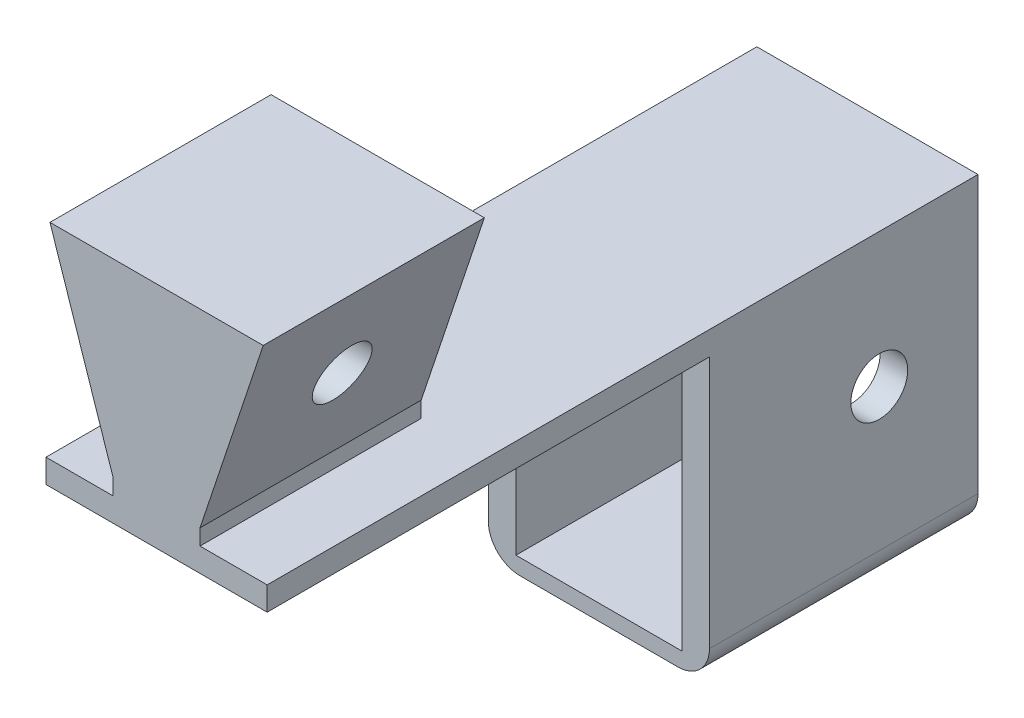
ISO-10303-21;
HEADER;
FILE_DESCRIPTION(('STEP AP214'),'2;1');
FILE_NAME('part.step','',(''),(''),'','','');
FILE_SCHEMA(('AUTOMOTIVE_DESIGN { 1 0 10303 214 1 1 1 1 }'));
ENDSEC;
DATA;
#1=APPLICATION_CONTEXT('core data for automotive mechanical design processes');
#2=APPLICATION_PROTOCOL_DEFINITION('international standard','automotive_design',2000,#1);
#3=PRODUCT_CONTEXT('',#1,'mechanical');
#4=PRODUCT('Part','Part','',(#3));
#5=PRODUCT_RELATED_PRODUCT_CATEGORY('part','',(#4));
#6=PRODUCT_DEFINITION_FORMATION('','',#4);
#7=PRODUCT_DEFINITION_CONTEXT('part definition',#1,'design');
#8=PRODUCT_DEFINITION('design','',#6,#7);
#9=PRODUCT_DEFINITION_SHAPE('','',#8);
#10=(LENGTH_UNIT() NAMED_UNIT(*) SI_UNIT(.MILLI.,.METRE.));
#11=(NAMED_UNIT(*) PLANE_ANGLE_UNIT() SI_UNIT($,.RADIAN.));
#12=(NAMED_UNIT(*) SI_UNIT($,.STERADIAN.) SOLID_ANGLE_UNIT());
#13=UNCERTAINTY_MEASURE_WITH_UNIT(LENGTH_MEASURE(1.E-05),#10,'distance_accuracy_value','');
#14=(GEOMETRIC_REPRESENTATION_CONTEXT(3) GLOBAL_UNCERTAINTY_ASSIGNED_CONTEXT((#13)) GLOBAL_UNIT_ASSIGNED_CONTEXT((#10,
#11,#12)) REPRESENTATION_CONTEXT('',''));
#15=CARTESIAN_POINT('',(0.,0.,0.));
#16=DIRECTION('',(0.,0.,1.));
#17=DIRECTION('',(1.,0.,0.));
#18=AXIS2_PLACEMENT_3D('',#15,#16,#17);
#19=CARTESIAN_POINT('',(0.,-1.5,0.));
#20=DIRECTION('',(0.,-1.,0.));
#21=DIRECTION('',(0.,0.,-1.));
#22=AXIS2_PLACEMENT_3D('',#19,#20,#21);
#23=PLANE('',#22);
#24=DIRECTION('',(-1.,0.,0.));
#25=VECTOR('',#24,1.);
#26=CARTESIAN_POINT('',(-4.25,-1.5,-14.));
#27=LINE('',#26,#25);
#28=CARTESIAN_POINT('',(-2.5,-1.5,-14.));
#29=VERTEX_POINT('',#28);
#30=CARTESIAN_POINT('',(-4.25,-1.5,-14.));
#31=VERTEX_POINT('',#30);
#32=EDGE_CURVE('E210',#29,#31,#27,.T.);
#33=ORIENTED_EDGE('',*,*,#32,.F.);
#34=DIRECTION('',(0.,0.,1.));
#35=VECTOR('',#34,1.);
#36=CARTESIAN_POINT('',(-2.5,-1.5,-14.));
#37=LINE('',#36,#35);
#38=CARTESIAN_POINT('',(-2.5,-1.5,-31.));
#39=VERTEX_POINT('',#38);
#40=EDGE_CURVE('E211',#39,#29,#37,.T.);
#41=ORIENTED_EDGE('',*,*,#40,.F.);
#42=DIRECTION('',(1.,0.,0.));
#43=VECTOR('',#42,1.);
#44=CARTESIAN_POINT('',(-4.24999999999999,-1.5,-31.));
#45=LINE('',#44,#43);
#46=CARTESIAN_POINT('',(8.,-1.5,-31.));
#47=VERTEX_POINT('',#46);
#48=EDGE_CURVE('E239',#39,#47,#45,.T.);
#49=ORIENTED_EDGE('',*,*,#48,.T.);
#50=DIRECTION('',(0.,0.,-1.));
#51=VECTOR('',#50,1.);
#52=CARTESIAN_POINT('',(8.,-1.5,-14.));
#53=LINE('',#52,#51);
#54=CARTESIAN_POINT('',(8.,-1.5,-14.));
#55=VERTEX_POINT('',#54);
#56=EDGE_CURVE('E177',#55,#47,#53,.T.);
#57=ORIENTED_EDGE('',*,*,#56,.F.);
#58=DIRECTION('',(-1.,0.,0.));
#59=VECTOR('',#58,1.);
#60=CARTESIAN_POINT('',(9.75,-1.5,-14.));
#61=LINE('',#60,#59);
#62=CARTESIAN_POINT('',(9.75,-1.5,-14.));
#63=VERTEX_POINT('',#62);
#64=EDGE_CURVE('E186',#63,#55,#61,.T.);
#65=ORIENTED_EDGE('',*,*,#64,.F.);
#66=DIRECTION('',(0.,0.,1.));
#67=VECTOR('',#66,1.);
#68=CARTESIAN_POINT('',(9.75,-1.5,14.));
#69=LINE('',#68,#67);
#70=CARTESIAN_POINT('',(9.75,-1.5,14.));
#71=VERTEX_POINT('',#70);
#72=EDGE_CURVE('E243',#63,#71,#69,.T.);
#73=ORIENTED_EDGE('',*,*,#72,.T.);
#74=DIRECTION('',(-1.,0.,0.));
#75=VECTOR('',#74,1.);
#76=CARTESIAN_POINT('',(-4.25,-1.5,14.));
#77=LINE('',#76,#75);
#78=CARTESIAN_POINT('',(-4.25,-1.5,14.));
#79=VERTEX_POINT('',#78);
#80=EDGE_CURVE('E246',#71,#79,#77,.T.);
#81=ORIENTED_EDGE('',*,*,#80,.T.);
#82=DIRECTION('',(0.,0.,-1.));
#83=VECTOR('',#82,1.);
#84=CARTESIAN_POINT('',(-4.25,-1.5,14.));
#85=LINE('',#84,#83);
#86=EDGE_CURVE('E235',#79,#31,#85,.T.);
#87=ORIENTED_EDGE('',*,*,#86,.T.);
#88=EDGE_LOOP('',(#33,#41,#49,#57,#65,#73,#81,#87));
#89=FACE_BOUND('',#88,.T.);
#90=ADVANCED_FACE('F39',(#89),#23,.T.);
#91=CARTESIAN_POINT('',(0.,0.999999999999998,14.));
#92=DIRECTION('',(1.,0.,0.));
#93=DIRECTION('',(0.,0.,-1.));
#94=AXIS2_PLACEMENT_3D('',#91,#92,#93);
#95=PLANE('',#94);
#96=DIRECTION('',(0.,-1.,0.));
#97=VECTOR('',#96,1.);
#98=CARTESIAN_POINT('',(0.,0.999999999999998,0.));
#99=LINE('',#98,#97);
#100=CARTESIAN_POINT('',(0.,0.999999999999998,0.));
#101=VERTEX_POINT('',#100);
#102=CARTESIAN_POINT('',(0.,0.,0.));
#103=VERTEX_POINT('',#102);
#104=EDGE_CURVE('E295',#101,#103,#99,.T.);
#105=ORIENTED_EDGE('',*,*,#104,.T.);
#106=DIRECTION('',(0.,0.,-1.));
#107=VECTOR('',#106,1.);
#108=CARTESIAN_POINT('',(0.,0.,14.));
#109=LINE('',#108,#107);
#110=CARTESIAN_POINT('',(0.,0.,14.));
#111=VERTEX_POINT('',#110);
#112=EDGE_CURVE('E331',#111,#103,#109,.T.);
#113=ORIENTED_EDGE('',*,*,#112,.F.);
#114=DIRECTION('',(0.,-1.,0.));
#115=VECTOR('',#114,1.);
#116=CARTESIAN_POINT('',(0.,0.999999999999998,14.));
#117=LINE('',#116,#115);
#118=CARTESIAN_POINT('',(0.,0.999999999999998,14.));
#119=VERTEX_POINT('',#118);
#120=EDGE_CURVE('E278',#119,#111,#117,.T.);
#121=ORIENTED_EDGE('',*,*,#120,.F.);
#122=DIRECTION('',(0.,0.,-1.));
#123=VECTOR('',#122,1.);
#124=CARTESIAN_POINT('',(0.,0.999999999999998,14.));
#125=LINE('',#124,#123);
#126=EDGE_CURVE('E294',#119,#101,#125,.T.);
#127=ORIENTED_EDGE('',*,*,#126,.T.);
#128=EDGE_LOOP('',(#105,#113,#121,#127));
#129=FACE_BOUND('',#128,.T.);
#130=ADVANCED_FACE('F427',(#129),#95,.F.);
#131=CARTESIAN_POINT('',(5.5,0.,14.));
#132=DIRECTION('',(-1.,0.,0.));
#133=DIRECTION('',(0.,0.,1.));
#134=AXIS2_PLACEMENT_3D('',#131,#132,#133);
#135=PLANE('',#134);
#136=DIRECTION('',(0.,1.,0.));
#137=VECTOR('',#136,1.);
#138=CARTESIAN_POINT('',(5.5,0.,0.));
#139=LINE('',#138,#137);
#140=CARTESIAN_POINT('',(5.5,0.,0.));
#141=VERTEX_POINT('',#140);
#142=CARTESIAN_POINT('',(5.5,0.999999999999999,0.));
#143=VERTEX_POINT('',#142);
#144=EDGE_CURVE('E302',#141,#143,#139,.T.);
#145=ORIENTED_EDGE('',*,*,#144,.T.);
#146=DIRECTION('',(0.,0.,-1.));
#147=VECTOR('',#146,1.);
#148=CARTESIAN_POINT('',(5.5,0.999999999999999,14.));
#149=LINE('',#148,#147);
#150=CARTESIAN_POINT('',(5.5,0.999999999999999,14.));
#151=VERTEX_POINT('',#150);
#152=EDGE_CURVE('E324',#151,#143,#149,.T.);
#153=ORIENTED_EDGE('',*,*,#152,.F.);
#154=DIRECTION('',(0.,1.,0.));
#155=VECTOR('',#154,1.);
#156=CARTESIAN_POINT('',(5.5,0.,14.));
#157=LINE('',#156,#155);
#158=CARTESIAN_POINT('',(5.5,0.,14.));
#159=VERTEX_POINT('',#158);
#160=EDGE_CURVE('E281',#159,#151,#157,.T.);
#161=ORIENTED_EDGE('',*,*,#160,.F.);
#162=DIRECTION('',(0.,0.,-1.));
#163=VECTOR('',#162,1.);
#164=CARTESIAN_POINT('',(5.5,0.,14.));
#165=LINE('',#164,#163);
#166=EDGE_CURVE('E328',#159,#141,#165,.T.);
#167=ORIENTED_EDGE('',*,*,#166,.T.);
#168=EDGE_LOOP('',(#145,#153,#161,#167));
#169=FACE_BOUND('',#168,.T.);
#170=ADVANCED_FACE('F432',(#169),#135,.F.);
#171=CARTESIAN_POINT('',(5.5,0.999999999999999,14.));
#172=DIRECTION('',(-0.948683298050514,0.316227766016838,0.));
#173=DIRECTION('',(-0.316227766016838,-0.948683298050514,0.));
#174=AXIS2_PLACEMENT_3D('',#171,#172,#173);
#175=PLANE('',#174);
#176=CARTESIAN_POINT('',(7.5,7.,7.));
#177=DIRECTION('',(-0.948683298050514,0.316227766016838,0.));
#178=DIRECTION('',(-0.316227766016838,-0.948683298050514,0.));
#179=AXIS2_PLACEMENT_3D('',#176,#177,#178);
#180=ELLIPSE('',#179,1.89736659610102,1.79999999999999);
#181=CARTESIAN_POINT('',(6.9,5.20000000000001,7.));
#182=VERTEX_POINT('',#181);
#183=EDGE_CURVE('E277',#182,#182,#180,.T.);
#184=ORIENTED_EDGE('',*,*,#183,.T.);
#185=EDGE_LOOP('',(#184));
#186=FACE_BOUND('',#185,.T.);
#187=DIRECTION('',(0.316227766016838,0.948683298050514,0.));
#188=VECTOR('',#187,1.);
#189=CARTESIAN_POINT('',(5.5,0.999999999999999,0.));
#190=LINE('',#189,#188);
#191=CARTESIAN_POINT('',(9.5,13.,0.));
#192=VERTEX_POINT('',#191);
#193=EDGE_CURVE('E305',#143,#192,#190,.T.);
#194=ORIENTED_EDGE('',*,*,#193,.T.);
#195=DIRECTION('',(0.,0.,-1.));
#196=VECTOR('',#195,1.);
#197=CARTESIAN_POINT('',(9.5,13.,14.));
#198=LINE('',#197,#196);
#199=CARTESIAN_POINT('',(9.5,13.,14.));
#200=VERTEX_POINT('',#199);
#201=EDGE_CURVE('E320',#200,#192,#198,.T.);
#202=ORIENTED_EDGE('',*,*,#201,.F.);
#203=DIRECTION('',(0.316227766016838,0.948683298050514,0.));
#204=VECTOR('',#203,1.);
#205=CARTESIAN_POINT('',(5.5,0.999999999999999,14.));
#206=LINE('',#205,#204);
#207=EDGE_CURVE('E285',#151,#200,#206,.T.);
#208=ORIENTED_EDGE('',*,*,#207,.F.);
#209=ORIENTED_EDGE('',*,*,#152,.T.);
#210=EDGE_LOOP('',(#194,#202,#208,#209));
#211=FACE_BOUND('',#210,.T.);
#212=ADVANCED_FACE('F614',(#186,#211),#175,.F.);
#213=CARTESIAN_POINT('',(9.5,13.,14.));
#214=DIRECTION('',(0.,-1.,0.));
#215=DIRECTION('',(1.,0.,0.));
#216=AXIS2_PLACEMENT_3D('',#213,#214,#215);
#217=PLANE('',#216);
#218=DIRECTION('',(-1.,0.,0.));
#219=VECTOR('',#218,1.);
#220=CARTESIAN_POINT('',(9.5,13.,0.));
#221=LINE('',#220,#219);
#222=CARTESIAN_POINT('',(-4.,13.,0.));
#223=VERTEX_POINT('',#222);
#224=EDGE_CURVE('E308',#192,#223,#221,.T.);
#225=ORIENTED_EDGE('',*,*,#224,.T.);
#226=DIRECTION('',(0.,0.,-1.));
#227=VECTOR('',#226,1.);
#228=CARTESIAN_POINT('',(-4.,13.,14.));
#229=LINE('',#228,#227);
#230=CARTESIAN_POINT('',(-4.,13.,14.));
#231=VERTEX_POINT('',#230);
#232=EDGE_CURVE('E316',#231,#223,#229,.T.);
#233=ORIENTED_EDGE('',*,*,#232,.F.);
#234=DIRECTION('',(-1.,0.,0.));
#235=VECTOR('',#234,1.);
#236=CARTESIAN_POINT('',(9.5,13.,14.));
#237=LINE('',#236,#235);
#238=EDGE_CURVE('E288',#200,#231,#237,.T.);
#239=ORIENTED_EDGE('',*,*,#238,.F.);
#240=ORIENTED_EDGE('',*,*,#201,.T.);
#241=EDGE_LOOP('',(#225,#233,#239,#240));
#242=FACE_BOUND('',#241,.T.);
#243=ADVANCED_FACE('F523',(#242),#217,.F.);
#244=CARTESIAN_POINT('',(-4.,13.,14.));
#245=DIRECTION('',(0.948683298050514,0.316227766016838,0.));
#246=DIRECTION('',(-0.316227766016838,0.948683298050514,0.));
#247=AXIS2_PLACEMENT_3D('',#244,#245,#246);
#248=PLANE('',#247);
#249=CARTESIAN_POINT('',(-2.,7.,7.));
#250=DIRECTION('',(0.948683298050514,0.316227766016838,0.));
#251=DIRECTION('',(0.316227766016838,-0.948683298050514,0.));
#252=AXIS2_PLACEMENT_3D('',#249,#250,#251);
#253=ELLIPSE('',#252,1.89736659610102,1.79999999999999);
#254=CARTESIAN_POINT('',(-1.4,5.20000000000001,7.));
#255=VERTEX_POINT('',#254);
#256=EDGE_CURVE('E402',#255,#255,#253,.T.);
#257=ORIENTED_EDGE('',*,*,#256,.T.);
#258=EDGE_LOOP('',(#257));
#259=FACE_BOUND('',#258,.T.);
#260=DIRECTION('',(0.316227766016838,-0.948683298050514,0.));
#261=VECTOR('',#260,1.);
#262=CARTESIAN_POINT('',(-4.,13.,0.));
#263=LINE('',#262,#261);
#264=EDGE_CURVE('E282',#223,#101,#263,.T.);
#265=ORIENTED_EDGE('',*,*,#264,.T.);
#266=ORIENTED_EDGE('',*,*,#126,.F.);
#267=DIRECTION('',(0.316227766016838,-0.948683298050514,0.));
#268=VECTOR('',#267,1.);
#269=CARTESIAN_POINT('',(-4.,13.,14.));
#270=LINE('',#269,#268);
#271=EDGE_CURVE('E291',#231,#119,#270,.T.);
#272=ORIENTED_EDGE('',*,*,#271,.F.);
#273=ORIENTED_EDGE('',*,*,#232,.T.);
#274=EDGE_LOOP('',(#265,#266,#272,#273));
#275=FACE_BOUND('',#274,.T.);
#276=ADVANCED_FACE('F407',(#259,#275),#248,.F.);
#277=CARTESIAN_POINT('',(0.,0.,14.));
#278=DIRECTION('',(0.,0.,1.));
#279=DIRECTION('',(1.,0.,0.));
#280=AXIS2_PLACEMENT_3D('',#277,#278,#279);
#281=PLANE('',#280);
#282=ORIENTED_EDGE('',*,*,#120,.T.);
#283=DIRECTION('',(-1.,0.,0.));
#284=VECTOR('',#283,1.);
#285=CARTESIAN_POINT('',(-4.25,0.,14.));
#286=LINE('',#285,#284);
#287=CARTESIAN_POINT('',(-4.25,0.,14.));
#288=VERTEX_POINT('',#287);
#289=EDGE_CURVE('E260',#111,#288,#286,.T.);
#290=ORIENTED_EDGE('',*,*,#289,.T.);
#291=DIRECTION('',(0.,1.,0.));
#292=VECTOR('',#291,1.);
#293=CARTESIAN_POINT('',(-4.25,-1.5,14.));
#294=LINE('',#293,#292);
#295=EDGE_CURVE('E249',#79,#288,#294,.T.);
#296=ORIENTED_EDGE('',*,*,#295,.F.);
#297=ORIENTED_EDGE('',*,*,#80,.F.);
#298=DIRECTION('',(0.,1.,0.));
#299=VECTOR('',#298,1.);
#300=CARTESIAN_POINT('',(9.75,-1.5,14.));
#301=LINE('',#300,#299);
#302=CARTESIAN_POINT('',(9.75,0.,14.));
#303=VERTEX_POINT('',#302);
#304=EDGE_CURVE('E267',#71,#303,#301,.T.);
#305=ORIENTED_EDGE('',*,*,#304,.T.);
#306=EDGE_CURVE('E240',#303,#159,#286,.T.);
#307=ORIENTED_EDGE('',*,*,#306,.T.);
#308=ORIENTED_EDGE('',*,*,#160,.T.);
#309=ORIENTED_EDGE('',*,*,#207,.T.);
#310=ORIENTED_EDGE('',*,*,#238,.T.);
#311=ORIENTED_EDGE('',*,*,#271,.T.);
#312=EDGE_LOOP('',(#282,#290,#296,#297,#305,#307,#308,#309,#310,#311));
#313=FACE_BOUND('',#312,.T.);
#314=ADVANCED_FACE('F421',(#313),#281,.T.);
#315=CARTESIAN_POINT('',(0.,0.,0.));
#316=DIRECTION('',(0.,0.,1.));
#317=DIRECTION('',(1.,0.,0.));
#318=AXIS2_PLACEMENT_3D('',#315,#316,#317);
#319=PLANE('',#318);
#320=ORIENTED_EDGE('',*,*,#104,.F.);
#321=ORIENTED_EDGE('',*,*,#264,.F.);
#322=ORIENTED_EDGE('',*,*,#224,.F.);
#323=ORIENTED_EDGE('',*,*,#193,.F.);
#324=ORIENTED_EDGE('',*,*,#144,.F.);
#325=DIRECTION('',(1.,0.,0.));
#326=VECTOR('',#325,1.);
#327=CARTESIAN_POINT('',(0.,0.,0.));
#328=LINE('',#327,#326);
#329=EDGE_CURVE('E298',#103,#141,#328,.T.);
#330=ORIENTED_EDGE('',*,*,#329,.F.);
#331=EDGE_LOOP('',(#320,#321,#322,#323,#324,#330));
#332=FACE_BOUND('',#331,.T.);
#333=ADVANCED_FACE('F412',(#332),#319,.F.);
#334=CARTESIAN_POINT('',(0.,7.,7.));
#335=DIRECTION('',(-1.,0.,0.));
#336=DIRECTION('',(0.,0.,1.));
#337=AXIS2_PLACEMENT_3D('',#334,#335,#336);
#338=CYLINDRICAL_SURFACE('',#337,1.79999999999999);
#339=ORIENTED_EDGE('',*,*,#183,.F.);
#340=EDGE_LOOP('',(#339));
#341=FACE_BOUND('',#340,.T.);
#342=ORIENTED_EDGE('',*,*,#256,.F.);
#343=EDGE_LOOP('',(#342));
#344=FACE_BOUND('',#343,.T.);
#345=ADVANCED_FACE('F410',(#341,#344),#338,.F.);
#346=CARTESIAN_POINT('',(-4.25,-1.5,14.));
#347=DIRECTION('',(1.,0.,0.));
#348=DIRECTION('',(0.,0.,-1.));
#349=AXIS2_PLACEMENT_3D('',#346,#347,#348);
#350=PLANE('',#349);
#351=CARTESIAN_POINT('',(-4.25,-8.5,-24.75));
#352=DIRECTION('',(-1.,0.,0.));
#353=DIRECTION('',(0.,0.,1.));
#354=AXIS2_PLACEMENT_3D('',#351,#352,#353);
#355=CIRCLE('',#354,1.79999999999999);
#356=CARTESIAN_POINT('',(-4.25,-8.5,-22.95));
#357=VERTEX_POINT('',#356);
#358=EDGE_CURVE('E398',#357,#357,#355,.T.);
#359=ORIENTED_EDGE('',*,*,#358,.F.);
#360=EDGE_LOOP('',(#359));
#361=FACE_BOUND('',#360,.T.);
#362=DIRECTION('',(0.,1.,0.));
#363=VECTOR('',#362,1.);
#364=CARTESIAN_POINT('',(-4.24999999999999,-1.5,-31.));
#365=LINE('',#364,#363);
#366=CARTESIAN_POINT('',(-4.24999999999999,-17.5,-31.));
#367=VERTEX_POINT('',#366);
#368=CARTESIAN_POINT('',(-4.24999999999999,0.,-31.));
#369=VERTEX_POINT('',#368);
#370=EDGE_CURVE('E274',#367,#369,#365,.T.);
#371=ORIENTED_EDGE('',*,*,#370,.F.);
#372=DIRECTION('',(0.,0.,-1.));
#373=VECTOR('',#372,1.);
#374=CARTESIAN_POINT('',(-4.25,-17.5,-14.));
#375=LINE('',#374,#373);
#376=CARTESIAN_POINT('',(-4.25,-17.5,-14.));
#377=VERTEX_POINT('',#376);
#378=EDGE_CURVE('E11',#367,#377,#375,.F.);
#379=ORIENTED_EDGE('',*,*,#378,.T.);
#380=DIRECTION('',(0.,1.,0.));
#381=VECTOR('',#380,1.);
#382=CARTESIAN_POINT('',(-4.25,-18.5,-14.));
#383=LINE('',#382,#381);
#384=EDGE_CURVE('E209',#377,#31,#383,.T.);
#385=ORIENTED_EDGE('',*,*,#384,.T.);
#386=ORIENTED_EDGE('',*,*,#86,.F.);
#387=ORIENTED_EDGE('',*,*,#295,.T.);
#388=DIRECTION('',(0.,0.,-1.));
#389=VECTOR('',#388,1.);
#390=CARTESIAN_POINT('',(-4.25,0.,14.));
#391=LINE('',#390,#389);
#392=EDGE_CURVE('E234',#288,#369,#391,.T.);
#393=ORIENTED_EDGE('',*,*,#392,.T.);
#394=EDGE_LOOP('',(#371,#379,#385,#386,#387,#393));
#395=FACE_BOUND('',#394,.T.);
#396=ADVANCED_FACE('F381',(#361,#395),#350,.F.);
#397=CARTESIAN_POINT('',(-4.24999999999999,-1.5,-31.));
#398=DIRECTION('',(0.,0.,1.));
#399=DIRECTION('',(1.,0.,0.));
#400=AXIS2_PLACEMENT_3D('',#397,#398,#399);
#401=PLANE('',#400);
#402=DIRECTION('',(0.,1.,0.));
#403=VECTOR('',#402,1.);
#404=CARTESIAN_POINT('',(9.75,-1.5,-31.));
#405=LINE('',#404,#403);
#406=CARTESIAN_POINT('',(9.75,-17.5,-31.));
#407=VERTEX_POINT('',#406);
#408=CARTESIAN_POINT('',(9.75,0.,-31.));
#409=VERTEX_POINT('',#408);
#410=EDGE_CURVE('E271',#407,#409,#405,.T.);
#411=ORIENTED_EDGE('',*,*,#410,.F.);
#412=CARTESIAN_POINT('',(7.75,-17.5,-31.));
#413=DIRECTION('',(0.,0.,1.));
#414=DIRECTION('',(1.,0.,0.));
#415=AXIS2_PLACEMENT_3D('',#412,#413,#414);
#416=CIRCLE('',#415,2.);
#417=CARTESIAN_POINT('',(7.75,-19.5,-31.));
#418=VERTEX_POINT('',#417);
#419=EDGE_CURVE('E48',#407,#418,#416,.F.);
#420=ORIENTED_EDGE('',*,*,#419,.T.);
#421=DIRECTION('',(1.,0.,0.));
#422=VECTOR('',#421,1.);
#423=CARTESIAN_POINT('',(-4.25,-19.5,-31.));
#424=LINE('',#423,#422);
#425=CARTESIAN_POINT('',(-2.25,-19.5,-31.));
#426=VERTEX_POINT('',#425);
#427=EDGE_CURVE('E195',#426,#418,#424,.T.);
#428=ORIENTED_EDGE('',*,*,#427,.F.);
#429=CARTESIAN_POINT('',(-2.25,-17.5,-31.));
#430=DIRECTION('',(0.,0.,1.));
#431=DIRECTION('',(1.,0.,0.));
#432=AXIS2_PLACEMENT_3D('',#429,#430,#431);
#433=CIRCLE('',#432,2.);
#434=EDGE_CURVE('E55',#426,#367,#433,.F.);
#435=ORIENTED_EDGE('',*,*,#434,.T.);
#436=ORIENTED_EDGE('',*,*,#370,.T.);
#437=DIRECTION('',(1.,0.,0.));
#438=VECTOR('',#437,1.);
#439=CARTESIAN_POINT('',(-4.24999999999999,0.,-31.));
#440=LINE('',#439,#438);
#441=EDGE_CURVE('E253',#369,#409,#440,.T.);
#442=ORIENTED_EDGE('',*,*,#441,.T.);
#443=EDGE_LOOP('',(#411,#420,#428,#435,#436,#442));
#444=FACE_BOUND('',#443,.T.);
#445=DIRECTION('',(1.,0.,0.));
#446=VECTOR('',#445,1.);
#447=CARTESIAN_POINT('',(-4.25,-18.5,-31.));
#448=LINE('',#447,#446);
#449=CARTESIAN_POINT('',(-2.5,-18.5,-31.));
#450=VERTEX_POINT('',#449);
#451=CARTESIAN_POINT('',(8.00000000000001,-18.5,-31.));
#452=VERTEX_POINT('',#451);
#453=EDGE_CURVE('E196',#450,#452,#448,.T.);
#454=ORIENTED_EDGE('',*,*,#453,.T.);
#455=DIRECTION('',(0.,1.,0.));
#456=VECTOR('',#455,1.);
#457=CARTESIAN_POINT('',(8.00000000000001,-18.5,-31.));
#458=LINE('',#457,#456);
#459=EDGE_CURVE('E171',#452,#47,#458,.T.);
#460=ORIENTED_EDGE('',*,*,#459,.T.);
#461=ORIENTED_EDGE('',*,*,#48,.F.);
#462=DIRECTION('',(0.,1.,0.));
#463=VECTOR('',#462,1.);
#464=CARTESIAN_POINT('',(-2.5,-18.5,-31.));
#465=LINE('',#464,#463);
#466=EDGE_CURVE('E223',#450,#39,#465,.T.);
#467=ORIENTED_EDGE('',*,*,#466,.F.);
#468=EDGE_LOOP('',(#454,#460,#461,#467));
#469=FACE_BOUND('',#468,.T.);
#470=ADVANCED_FACE('F357',(#444,#469),#401,.F.);
#471=CARTESIAN_POINT('',(9.75,-1.5,14.));
#472=DIRECTION('',(-1.,0.,0.));
#473=DIRECTION('',(0.,0.,1.));
#474=AXIS2_PLACEMENT_3D('',#471,#472,#473);
#475=PLANE('',#474);
#476=CARTESIAN_POINT('',(9.75000000000001,-8.5,-24.75));
#477=DIRECTION('',(-1.,0.,0.));
#478=DIRECTION('',(0.,0.,1.));
#479=AXIS2_PLACEMENT_3D('',#476,#477,#478);
#480=CIRCLE('',#479,1.8);
#481=CARTESIAN_POINT('',(9.75000000000001,-8.5,-22.95));
#482=VERTEX_POINT('',#481);
#483=EDGE_CURVE('E394',#482,#482,#480,.T.);
#484=ORIENTED_EDGE('',*,*,#483,.T.);
#485=EDGE_LOOP('',(#484));
#486=FACE_BOUND('',#485,.T.);
#487=DIRECTION('',(0.,1.,0.));
#488=VECTOR('',#487,1.);
#489=CARTESIAN_POINT('',(9.75,-18.5,-14.));
#490=LINE('',#489,#488);
#491=CARTESIAN_POINT('',(9.75,-17.5,-14.));
#492=VERTEX_POINT('',#491);
#493=EDGE_CURVE('E188',#492,#63,#490,.T.);
#494=ORIENTED_EDGE('',*,*,#493,.F.);
#495=DIRECTION('',(0.,0.,1.));
#496=VECTOR('',#495,1.);
#497=CARTESIAN_POINT('',(9.75,-17.5,-31.));
#498=LINE('',#497,#496);
#499=EDGE_CURVE('E63',#492,#407,#498,.F.);
#500=ORIENTED_EDGE('',*,*,#499,.T.);
#501=ORIENTED_EDGE('',*,*,#410,.T.);
#502=DIRECTION('',(0.,0.,1.));
#503=VECTOR('',#502,1.);
#504=CARTESIAN_POINT('',(9.75,0.,14.));
#505=LINE('',#504,#503);
#506=EDGE_CURVE('E257',#409,#303,#505,.T.);
#507=ORIENTED_EDGE('',*,*,#506,.T.);
#508=ORIENTED_EDGE('',*,*,#304,.F.);
#509=ORIENTED_EDGE('',*,*,#72,.F.);
#510=EDGE_LOOP('',(#494,#500,#501,#507,#508,#509));
#511=FACE_BOUND('',#510,.T.);
#512=ADVANCED_FACE('F367',(#486,#511),#475,.F.);
#513=CARTESIAN_POINT('',(0.,0.,0.));
#514=DIRECTION('',(0.,-1.,0.));
#515=DIRECTION('',(0.,0.,-1.));
#516=AXIS2_PLACEMENT_3D('',#513,#514,#515);
#517=PLANE('',#516);
#518=ORIENTED_EDGE('',*,*,#166,.F.);
#519=ORIENTED_EDGE('',*,*,#306,.F.);
#520=ORIENTED_EDGE('',*,*,#506,.F.);
#521=ORIENTED_EDGE('',*,*,#441,.F.);
#522=ORIENTED_EDGE('',*,*,#392,.F.);
#523=ORIENTED_EDGE('',*,*,#289,.F.);
#524=ORIENTED_EDGE('',*,*,#112,.T.);
#525=ORIENTED_EDGE('',*,*,#329,.T.);
#526=EDGE_LOOP('',(#518,#519,#520,#521,#522,#523,#524,#525));
#527=FACE_BOUND('',#526,.T.);
#528=ADVANCED_FACE('F438',(#527),#517,.F.);
#529=CARTESIAN_POINT('',(9.75,-18.5,-14.));
#530=DIRECTION('',(0.,0.,-1.));
#531=DIRECTION('',(-1.,0.,0.));
#532=AXIS2_PLACEMENT_3D('',#529,#530,#531);
#533=PLANE('',#532);
#534=DIRECTION('',(-1.,0.,0.));
#535=VECTOR('',#534,1.);
#536=CARTESIAN_POINT('',(-4.25,-19.5,-14.));
#537=LINE('',#536,#535);
#538=CARTESIAN_POINT('',(7.75,-19.5,-14.));
#539=VERTEX_POINT('',#538);
#540=CARTESIAN_POINT('',(-2.25,-19.5,-14.));
#541=VERTEX_POINT('',#540);
#542=EDGE_CURVE('E201',#539,#541,#537,.T.);
#543=ORIENTED_EDGE('',*,*,#542,.F.);
#544=CARTESIAN_POINT('',(7.75,-17.5,-14.));
#545=DIRECTION('',(0.,0.,-1.));
#546=DIRECTION('',(-1.,0.,0.));
#547=AXIS2_PLACEMENT_3D('',#544,#545,#546);
#548=CIRCLE('',#547,2.);
#549=EDGE_CURVE('E349',#539,#492,#548,.F.);
#550=ORIENTED_EDGE('',*,*,#549,.T.);
#551=ORIENTED_EDGE('',*,*,#493,.T.);
#552=ORIENTED_EDGE('',*,*,#64,.T.);
#553=DIRECTION('',(0.,1.,0.));
#554=VECTOR('',#553,1.);
#555=CARTESIAN_POINT('',(8.,-18.5,-14.));
#556=LINE('',#555,#554);
#557=CARTESIAN_POINT('',(8.,-18.5,-14.));
#558=VERTEX_POINT('',#557);
#559=EDGE_CURVE('E169',#558,#55,#556,.T.);
#560=ORIENTED_EDGE('',*,*,#559,.F.);
#561=DIRECTION('',(-1.,0.,0.));
#562=VECTOR('',#561,1.);
#563=CARTESIAN_POINT('',(-4.25,-18.5,-14.));
#564=LINE('',#563,#562);
#565=CARTESIAN_POINT('',(-2.5,-18.5,-14.));
#566=VERTEX_POINT('',#565);
#567=EDGE_CURVE('E184',#558,#566,#564,.T.);
#568=ORIENTED_EDGE('',*,*,#567,.T.);
#569=DIRECTION('',(0.,1.,0.));
#570=VECTOR('',#569,1.);
#571=CARTESIAN_POINT('',(-2.5,-18.5,-14.));
#572=LINE('',#571,#570);
#573=EDGE_CURVE('E220',#566,#29,#572,.T.);
#574=ORIENTED_EDGE('',*,*,#573,.T.);
#575=ORIENTED_EDGE('',*,*,#32,.T.);
#576=ORIENTED_EDGE('',*,*,#384,.F.);
#577=CARTESIAN_POINT('',(-2.25,-17.5,-14.));
#578=DIRECTION('',(0.,0.,-1.));
#579=DIRECTION('',(-1.,0.,0.));
#580=AXIS2_PLACEMENT_3D('',#577,#578,#579);
#581=CIRCLE('',#580,2.);
#582=EDGE_CURVE('E346',#377,#541,#581,.F.);
#583=ORIENTED_EDGE('',*,*,#582,.T.);
#584=EDGE_LOOP('',(#543,#550,#551,#552,#560,#568,#574,#575,#576,#583));
#585=FACE_BOUND('',#584,.T.);
#586=ADVANCED_FACE('F183',(#585),#533,.F.);
#587=CARTESIAN_POINT('',(8.,-18.5,-14.));
#588=DIRECTION('',(1.,0.,0.));
#589=DIRECTION('',(0.,0.,-1.));
#590=AXIS2_PLACEMENT_3D('',#587,#588,#589);
#591=PLANE('',#590);
#592=CARTESIAN_POINT('',(8.00000000000001,-8.5,-24.75));
#593=DIRECTION('',(1.,0.,0.));
#594=DIRECTION('',(0.,0.,-1.));
#595=AXIS2_PLACEMENT_3D('',#592,#593,#594);
#596=CIRCLE('',#595,1.79999999999999);
#597=CARTESIAN_POINT('',(8.00000000000001,-8.5,-26.55));
#598=VERTEX_POINT('',#597);
#599=EDGE_CURVE('E203',#598,#598,#596,.T.);
#600=ORIENTED_EDGE('',*,*,#599,.T.);
#601=EDGE_LOOP('',(#600));
#602=FACE_BOUND('',#601,.T.);
#603=ORIENTED_EDGE('',*,*,#56,.T.);
#604=ORIENTED_EDGE('',*,*,#459,.F.);
#605=DIRECTION('',(0.,0.,-1.));
#606=VECTOR('',#605,1.);
#607=CARTESIAN_POINT('',(8.,-18.5,-14.));
#608=LINE('',#607,#606);
#609=EDGE_CURVE('E165',#558,#452,#608,.T.);
#610=ORIENTED_EDGE('',*,*,#609,.F.);
#611=ORIENTED_EDGE('',*,*,#559,.T.);
#612=EDGE_LOOP('',(#603,#604,#610,#611));
#613=FACE_BOUND('',#612,.T.);
#614=ADVANCED_FACE('F168',(#602,#613),#591,.F.);
#615=CARTESIAN_POINT('',(-2.5,-18.5,-14.));
#616=DIRECTION('',(-1.,0.,0.));
#617=DIRECTION('',(0.,0.,1.));
#618=AXIS2_PLACEMENT_3D('',#615,#616,#617);
#619=PLANE('',#618);
#620=CARTESIAN_POINT('',(-2.5,-8.5,-24.75));
#621=DIRECTION('',(-1.,0.,0.));
#622=DIRECTION('',(0.,0.,1.));
#623=AXIS2_PLACEMENT_3D('',#620,#621,#622);
#624=CIRCLE('',#623,1.79999999999999);
#625=CARTESIAN_POINT('',(-2.5,-8.5,-22.95));
#626=VERTEX_POINT('',#625);
#627=EDGE_CURVE('E390',#626,#626,#624,.T.);
#628=ORIENTED_EDGE('',*,*,#627,.T.);
#629=EDGE_LOOP('',(#628));
#630=FACE_BOUND('',#629,.T.);
#631=ORIENTED_EDGE('',*,*,#40,.T.);
#632=ORIENTED_EDGE('',*,*,#573,.F.);
#633=DIRECTION('',(0.,0.,1.));
#634=VECTOR('',#633,1.);
#635=CARTESIAN_POINT('',(-2.5,-18.5,-14.));
#636=LINE('',#635,#634);
#637=EDGE_CURVE('E193',#450,#566,#636,.T.);
#638=ORIENTED_EDGE('',*,*,#637,.F.);
#639=ORIENTED_EDGE('',*,*,#466,.T.);
#640=EDGE_LOOP('',(#631,#632,#638,#639));
#641=FACE_BOUND('',#640,.T.);
#642=ADVANCED_FACE('F376',(#630,#641),#619,.F.);
#643=CARTESIAN_POINT('',(0.,-18.5,0.));
#644=DIRECTION('',(0.,-1.,0.));
#645=DIRECTION('',(0.,0.,-1.));
#646=AXIS2_PLACEMENT_3D('',#643,#644,#645);
#647=PLANE('',#646);
#648=ORIENTED_EDGE('',*,*,#567,.F.);
#649=ORIENTED_EDGE('',*,*,#609,.T.);
#650=ORIENTED_EDGE('',*,*,#453,.F.);
#651=ORIENTED_EDGE('',*,*,#637,.T.);
#652=EDGE_LOOP('',(#648,#649,#650,#651));
#653=FACE_BOUND('',#652,.T.);
#654=ADVANCED_FACE('F191',(#653),#647,.F.);
#655=CARTESIAN_POINT('',(0.,-19.5,0.));
#656=DIRECTION('',(0.,-1.,0.));
#657=DIRECTION('',(0.,0.,-1.));
#658=AXIS2_PLACEMENT_3D('',#655,#656,#657);
#659=PLANE('',#658);
#660=ORIENTED_EDGE('',*,*,#427,.T.);
#661=DIRECTION('',(0.,0.,1.));
#662=VECTOR('',#661,1.);
#663=CARTESIAN_POINT('',(7.75,-19.5,-14.));
#664=LINE('',#663,#662);
#665=EDGE_CURVE('E342',#418,#539,#664,.T.);
#666=ORIENTED_EDGE('',*,*,#665,.T.);
#667=ORIENTED_EDGE('',*,*,#542,.T.);
#668=DIRECTION('',(0.,0.,-1.));
#669=VECTOR('',#668,1.);
#670=CARTESIAN_POINT('',(-2.25,-19.5,-31.));
#671=LINE('',#670,#669);
#672=EDGE_CURVE('E335',#541,#426,#671,.T.);
#673=ORIENTED_EDGE('',*,*,#672,.T.);
#674=EDGE_LOOP('',(#660,#666,#667,#673));
#675=FACE_BOUND('',#674,.T.);
#676=ADVANCED_FACE('F362',(#675),#659,.T.);
#677=CARTESIAN_POINT('',(-4.24999999999999,-8.5,-24.75));
#678=DIRECTION('',(-1.,0.,0.));
#679=DIRECTION('',(0.,0.,1.));
#680=AXIS2_PLACEMENT_3D('',#677,#678,#679);
#681=CYLINDRICAL_SURFACE('',#680,1.79999999999999);
#682=ORIENTED_EDGE('',*,*,#483,.F.);
#683=EDGE_LOOP('',(#682));
#684=FACE_BOUND('',#683,.T.);
#685=ORIENTED_EDGE('',*,*,#599,.F.);
#686=EDGE_LOOP('',(#685));
#687=FACE_BOUND('',#686,.T.);
#688=ADVANCED_FACE('F490',(#684,#687),#681,.F.);
#689=ORIENTED_EDGE('',*,*,#358,.T.);
#690=EDGE_LOOP('',(#689));
#691=FACE_BOUND('',#690,.T.);
#692=ORIENTED_EDGE('',*,*,#627,.F.);
#693=EDGE_LOOP('',(#692));
#694=FACE_BOUND('',#693,.T.);
#695=ADVANCED_FACE('F497',(#691,#694),#681,.F.);
#696=CARTESIAN_POINT('',(7.75,-17.5,0.));
#697=DIRECTION('',(0.,0.,-1.));
#698=DIRECTION('',(-1.,0.,0.));
#699=AXIS2_PLACEMENT_3D('',#696,#697,#698);
#700=CYLINDRICAL_SURFACE('',#699,2.);
#701=ORIENTED_EDGE('',*,*,#419,.F.);
#702=ORIENTED_EDGE('',*,*,#499,.F.);
#703=ORIENTED_EDGE('',*,*,#549,.F.);
#704=ORIENTED_EDGE('',*,*,#665,.F.);
#705=EDGE_LOOP('',(#701,#702,#703,#704));
#706=FACE_BOUND('',#705,.T.);
#707=ADVANCED_FACE('F365',(#706),#700,.T.);
#708=CARTESIAN_POINT('',(-2.25,-17.5,0.));
#709=DIRECTION('',(0.,0.,1.));
#710=DIRECTION('',(1.,0.,0.));
#711=AXIS2_PLACEMENT_3D('',#708,#709,#710);
#712=CYLINDRICAL_SURFACE('',#711,2.);
#713=ORIENTED_EDGE('',*,*,#582,.F.);
#714=ORIENTED_EDGE('',*,*,#378,.F.);
#715=ORIENTED_EDGE('',*,*,#434,.F.);
#716=ORIENTED_EDGE('',*,*,#672,.F.);
#717=EDGE_LOOP('',(#713,#714,#715,#716));
#718=FACE_BOUND('',#717,.T.);
#719=ADVANCED_FACE('F41',(#718),#712,.T.);
#720=CLOSED_SHELL('',(#90,#130,#170,#212,#243,#276,#314,#333,#345,#396,#470,#512,#528,#586,#614,
#642,#654,#676,#688,#695,#707,#719));
#721=MANIFOLD_SOLID_BREP('B2',#720);
#722=ADVANCED_BREP_SHAPE_REPRESENTATION('',(#18,#721),#14);
#723=SHAPE_DEFINITION_REPRESENTATION(#9,#722);
ENDSEC;
END-ISO-10303-21;
